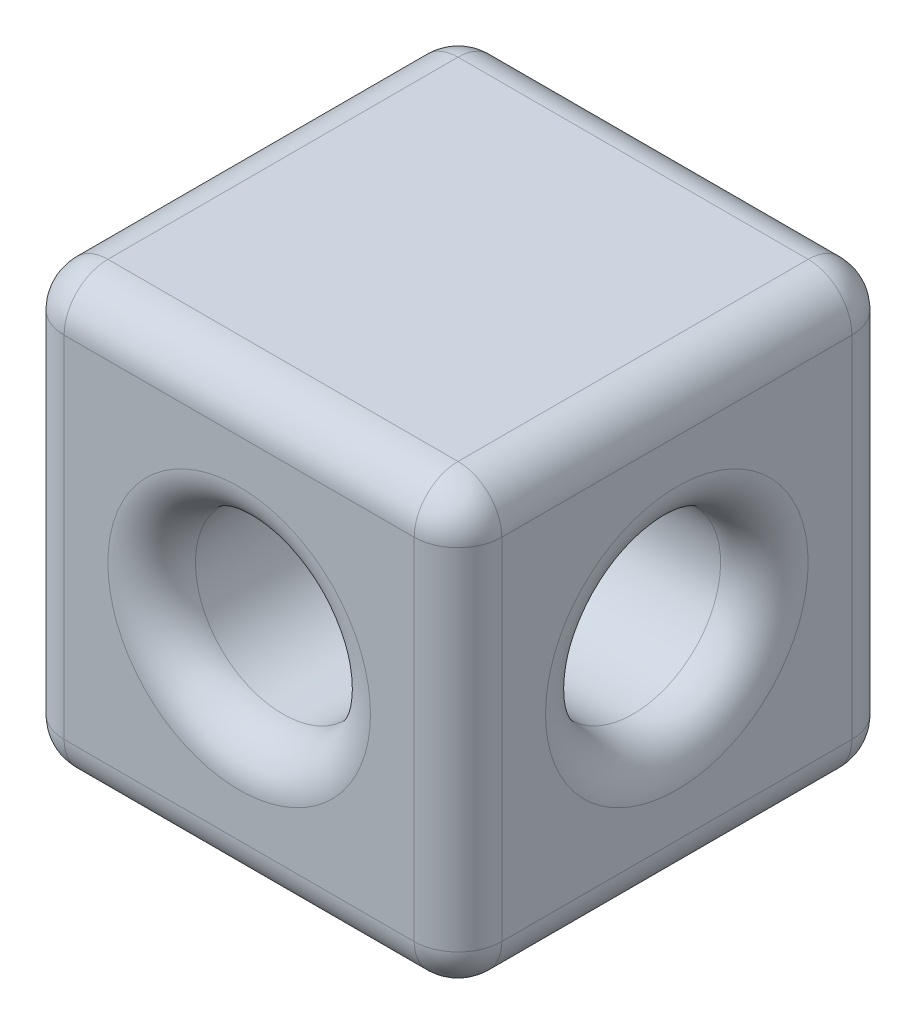
ISO-10303-21;
HEADER;
FILE_DESCRIPTION(('STEP AP214'),'2;1');
FILE_NAME('part.step','',(''),(''),'','','');
FILE_SCHEMA(('AUTOMOTIVE_DESIGN { 1 0 10303 214 1 1 1 1 }'));
ENDSEC;
DATA;
#1=APPLICATION_CONTEXT('core data for automotive mechanical design processes');
#2=APPLICATION_PROTOCOL_DEFINITION('international standard','automotive_design',2000,#1);
#3=PRODUCT_CONTEXT('',#1,'mechanical');
#4=PRODUCT('Part','Part','',(#3));
#5=PRODUCT_RELATED_PRODUCT_CATEGORY('part','',(#4));
#6=PRODUCT_DEFINITION_FORMATION('','',#4);
#7=PRODUCT_DEFINITION_CONTEXT('part definition',#1,'design');
#8=PRODUCT_DEFINITION('design','',#6,#7);
#9=PRODUCT_DEFINITION_SHAPE('','',#8);
#10=(LENGTH_UNIT() NAMED_UNIT(*) SI_UNIT(.MILLI.,.METRE.));
#11=(NAMED_UNIT(*) PLANE_ANGLE_UNIT() SI_UNIT($,.RADIAN.));
#12=(NAMED_UNIT(*) SI_UNIT($,.STERADIAN.) SOLID_ANGLE_UNIT());
#13=UNCERTAINTY_MEASURE_WITH_UNIT(LENGTH_MEASURE(1.E-05),#10,'distance_accuracy_value','');
#14=(GEOMETRIC_REPRESENTATION_CONTEXT(3) GLOBAL_UNCERTAINTY_ASSIGNED_CONTEXT((#13)) GLOBAL_UNIT_ASSIGNED_CONTEXT((#10,
#11,#12)) REPRESENTATION_CONTEXT('',''));
#15=CARTESIAN_POINT('',(0.,0.,0.));
#16=DIRECTION('',(0.,0.,1.));
#17=DIRECTION('',(1.,0.,0.));
#18=AXIS2_PLACEMENT_3D('',#15,#16,#17);
#19=CARTESIAN_POINT('',(0.,0.,5.));
#20=DIRECTION('',(0.,0.,-1.));
#21=DIRECTION('',(-1.,0.,0.));
#22=AXIS2_PLACEMENT_3D('',#19,#20,#21);
#23=CYLINDRICAL_SURFACE('',#22,1.);
#24=CARTESIAN_POINT('',(0.,0.,4.5));
#25=DIRECTION('',(0.,0.,-1.));
#26=DIRECTION('',(-1.,0.,0.));
#27=AXIS2_PLACEMENT_3D('',#24,#25,#26);
#28=CIRCLE('',#27,1.);
#29=CARTESIAN_POINT('',(-0.999999999999999,0.,4.5));
#30=VERTEX_POINT('',#29);
#31=EDGE_CURVE('E171',#30,#30,#28,.F.);
#32=ORIENTED_EDGE('',*,*,#31,.T.);
#33=EDGE_LOOP('',(#32));
#34=FACE_BOUND('',#33,.T.);
#35=CARTESIAN_POINT('',(0.,0.,2.5));
#36=DIRECTION('',(0.707106781186547,0.,-0.707106781186547));
#37=DIRECTION('',(-0.707106781186547,0.,-0.707106781186547));
#38=AXIS2_PLACEMENT_3D('',#35,#36,#37);
#39=ELLIPSE('',#38,1.41421356237309,1.);
#40=CARTESIAN_POINT('',(0.,-1.,2.5));
#41=VERTEX_POINT('',#40);
#42=CARTESIAN_POINT('',(0.,1.,2.5));
#43=VERTEX_POINT('',#42);
#44=EDGE_CURVE('E132',#41,#43,#39,.F.);
#45=ORIENTED_EDGE('',*,*,#44,.F.);
#46=CARTESIAN_POINT('',(0.,0.,2.5));
#47=DIRECTION('',(-0.707106781186547,0.,-0.707106781186547));
#48=DIRECTION('',(0.707106781186547,0.,-0.707106781186547));
#49=AXIS2_PLACEMENT_3D('',#46,#47,#48);
#50=ELLIPSE('',#49,1.41421356237309,1.);
#51=EDGE_CURVE('E136',#43,#41,#50,.F.);
#52=ORIENTED_EDGE('',*,*,#51,.F.);
#53=EDGE_LOOP('',(#45,#52));
#54=FACE_BOUND('',#53,.T.);
#55=ADVANCED_FACE('F32',(#34,#54),#23,.F.);
#56=CARTESIAN_POINT('',(0.,0.,5.));
#57=DIRECTION('',(0.,0.,-1.));
#58=DIRECTION('',(-1.,0.,0.));
#59=AXIS2_PLACEMENT_3D('',#56,#57,#58);
#60=PLANE('',#59);
#61=CARTESIAN_POINT('',(0.,0.,5.));
#62=DIRECTION('',(0.,0.,-1.));
#63=DIRECTION('',(-1.,0.,0.));
#64=AXIS2_PLACEMENT_3D('',#61,#62,#63);
#65=CIRCLE('',#64,1.5);
#66=CARTESIAN_POINT('',(-1.5,0.,5.));
#67=VERTEX_POINT('',#66);
#68=EDGE_CURVE('E183',#67,#67,#65,.T.);
#69=ORIENTED_EDGE('',*,*,#68,.T.);
#70=EDGE_LOOP('',(#69));
#71=FACE_BOUND('',#70,.T.);
#72=DIRECTION('',(0.,-1.,0.));
#73=VECTOR('',#72,1.);
#74=CARTESIAN_POINT('',(-2.,0.,5.));
#75=LINE('',#74,#73);
#76=CARTESIAN_POINT('',(-2.,2.,5.));
#77=VERTEX_POINT('',#76);
#78=CARTESIAN_POINT('',(-2.,-2.,5.));
#79=VERTEX_POINT('',#78);
#80=EDGE_CURVE('E178',#77,#79,#75,.T.);
#81=ORIENTED_EDGE('',*,*,#80,.T.);
#82=DIRECTION('',(1.,0.,0.));
#83=VECTOR('',#82,1.);
#84=CARTESIAN_POINT('',(0.,-2.,5.));
#85=LINE('',#84,#83);
#86=CARTESIAN_POINT('',(2.,-2.,5.));
#87=VERTEX_POINT('',#86);
#88=EDGE_CURVE('E180',#79,#87,#85,.T.);
#89=ORIENTED_EDGE('',*,*,#88,.T.);
#90=DIRECTION('',(0.,1.,0.));
#91=VECTOR('',#90,1.);
#92=CARTESIAN_POINT('',(2.,0.,5.));
#93=LINE('',#92,#91);
#94=CARTESIAN_POINT('',(2.,2.,5.));
#95=VERTEX_POINT('',#94);
#96=EDGE_CURVE('E174',#87,#95,#93,.T.);
#97=ORIENTED_EDGE('',*,*,#96,.T.);
#98=DIRECTION('',(-1.,0.,0.));
#99=VECTOR('',#98,1.);
#100=CARTESIAN_POINT('',(0.,2.,5.));
#101=LINE('',#100,#99);
#102=EDGE_CURVE('E176',#95,#77,#101,.T.);
#103=ORIENTED_EDGE('',*,*,#102,.T.);
#104=EDGE_LOOP('',(#81,#89,#97,#103));
#105=FACE_BOUND('',#104,.T.);
#106=ADVANCED_FACE('F319',(#71,#105),#60,.F.);
#107=CARTESIAN_POINT('',(0.,0.,0.));
#108=DIRECTION('',(0.,0.,-1.));
#109=DIRECTION('',(-1.,0.,0.));
#110=AXIS2_PLACEMENT_3D('',#107,#108,#109);
#111=PLANE('',#110);
#112=CARTESIAN_POINT('',(0.,0.,0.));
#113=DIRECTION('',(0.,0.,-1.));
#114=DIRECTION('',(-1.,0.,0.));
#115=AXIS2_PLACEMENT_3D('',#112,#113,#114);
#116=CIRCLE('',#115,1.5);
#117=CARTESIAN_POINT('',(-1.5,0.,0.));
#118=VERTEX_POINT('',#117);
#119=EDGE_CURVE('E41',#118,#118,#116,.F.);
#120=ORIENTED_EDGE('',*,*,#119,.T.);
#121=EDGE_LOOP('',(#120));
#122=FACE_BOUND('',#121,.T.);
#123=DIRECTION('',(0.,-1.,0.));
#124=VECTOR('',#123,1.);
#125=CARTESIAN_POINT('',(-2.,2.5,0.));
#126=LINE('',#125,#124);
#127=CARTESIAN_POINT('',(-2.,-2.,0.));
#128=VERTEX_POINT('',#127);
#129=CARTESIAN_POINT('',(-2.,2.,0.));
#130=VERTEX_POINT('',#129);
#131=EDGE_CURVE('E49',#128,#130,#126,.F.);
#132=ORIENTED_EDGE('',*,*,#131,.T.);
#133=DIRECTION('',(-1.,0.,0.));
#134=VECTOR('',#133,1.);
#135=CARTESIAN_POINT('',(2.5,2.,0.));
#136=LINE('',#135,#134);
#137=CARTESIAN_POINT('',(2.,2.,0.));
#138=VERTEX_POINT('',#137);
#139=EDGE_CURVE('E214',#130,#138,#136,.F.);
#140=ORIENTED_EDGE('',*,*,#139,.T.);
#141=DIRECTION('',(0.,1.,0.));
#142=VECTOR('',#141,1.);
#143=CARTESIAN_POINT('',(2.,-2.5,0.));
#144=LINE('',#143,#142);
#145=CARTESIAN_POINT('',(2.,-2.,0.));
#146=VERTEX_POINT('',#145);
#147=EDGE_CURVE('E210',#138,#146,#144,.F.);
#148=ORIENTED_EDGE('',*,*,#147,.T.);
#149=DIRECTION('',(1.,0.,0.));
#150=VECTOR('',#149,1.);
#151=CARTESIAN_POINT('',(-2.5,-2.,0.));
#152=LINE('',#151,#150);
#153=EDGE_CURVE('E54',#146,#128,#152,.F.);
#154=ORIENTED_EDGE('',*,*,#153,.T.);
#155=EDGE_LOOP('',(#132,#140,#148,#154));
#156=FACE_BOUND('',#155,.T.);
#157=ADVANCED_FACE('F350',(#122,#156),#111,.T.);
#158=CARTESIAN_POINT('',(2.5,-2.5,5.));
#159=DIRECTION('',(-1.,0.,0.));
#160=DIRECTION('',(0.,0.,1.));
#161=AXIS2_PLACEMENT_3D('',#158,#159,#160);
#162=PLANE('',#161);
#163=CARTESIAN_POINT('',(2.5,0.,2.5));
#164=DIRECTION('',(-1.,0.,0.));
#165=DIRECTION('',(0.,0.,1.));
#166=AXIS2_PLACEMENT_3D('',#163,#164,#165);
#167=CIRCLE('',#166,1.5);
#168=CARTESIAN_POINT('',(2.5,0.,4.));
#169=VERTEX_POINT('',#168);
#170=EDGE_CURVE('E204',#169,#169,#167,.T.);
#171=ORIENTED_EDGE('',*,*,#170,.T.);
#172=EDGE_LOOP('',(#171));
#173=FACE_BOUND('',#172,.T.);
#174=DIRECTION('',(0.,1.,0.));
#175=VECTOR('',#174,1.);
#176=CARTESIAN_POINT('',(2.5,-2.5,4.5));
#177=LINE('',#176,#175);
#178=CARTESIAN_POINT('',(2.5,2.,4.5));
#179=VERTEX_POINT('',#178);
#180=CARTESIAN_POINT('',(2.5,-2.,4.5));
#181=VERTEX_POINT('',#180);
#182=EDGE_CURVE('E199',#179,#181,#177,.F.);
#183=ORIENTED_EDGE('',*,*,#182,.T.);
#184=DIRECTION('',(0.,0.,-1.));
#185=VECTOR('',#184,1.);
#186=CARTESIAN_POINT('',(2.5,-2.,5.));
#187=LINE('',#186,#185);
#188=CARTESIAN_POINT('',(2.5,-2.,0.5));
#189=VERTEX_POINT('',#188);
#190=EDGE_CURVE('E201',#181,#189,#187,.T.);
#191=ORIENTED_EDGE('',*,*,#190,.T.);
#192=DIRECTION('',(0.,1.,0.));
#193=VECTOR('',#192,1.);
#194=CARTESIAN_POINT('',(2.5,2.5,0.5));
#195=LINE('',#194,#193);
#196=CARTESIAN_POINT('',(2.5,2.,0.5));
#197=VERTEX_POINT('',#196);
#198=EDGE_CURVE('E195',#189,#197,#195,.T.);
#199=ORIENTED_EDGE('',*,*,#198,.T.);
#200=DIRECTION('',(0.,0.,-1.));
#201=VECTOR('',#200,1.);
#202=CARTESIAN_POINT('',(2.5,2.,5.));
#203=LINE('',#202,#201);
#204=EDGE_CURVE('E197',#197,#179,#203,.F.);
#205=ORIENTED_EDGE('',*,*,#204,.T.);
#206=EDGE_LOOP('',(#183,#191,#199,#205));
#207=FACE_BOUND('',#206,.T.);
#208=ADVANCED_FACE('F335',(#173,#207),#162,.F.);
#209=CARTESIAN_POINT('',(-2.5,2.5,5.));
#210=DIRECTION('',(0.,-1.,0.));
#211=DIRECTION('',(0.,0.,-1.));
#212=AXIS2_PLACEMENT_3D('',#209,#210,#211);
#213=PLANE('',#212);
#214=DIRECTION('',(0.,0.,-1.));
#215=VECTOR('',#214,1.);
#216=CARTESIAN_POINT('',(-2.,2.5,5.));
#217=LINE('',#216,#215);
#218=CARTESIAN_POINT('',(-2.,2.5,0.5));
#219=VERTEX_POINT('',#218);
#220=CARTESIAN_POINT('',(-2.,2.5,4.5));
#221=VERTEX_POINT('',#220);
#222=EDGE_CURVE('E190',#219,#221,#217,.F.);
#223=ORIENTED_EDGE('',*,*,#222,.T.);
#224=DIRECTION('',(-1.,0.,0.));
#225=VECTOR('',#224,1.);
#226=CARTESIAN_POINT('',(-2.5,2.5,4.5));
#227=LINE('',#226,#225);
#228=CARTESIAN_POINT('',(2.,2.5,4.5));
#229=VERTEX_POINT('',#228);
#230=EDGE_CURVE('E192',#221,#229,#227,.F.);
#231=ORIENTED_EDGE('',*,*,#230,.T.);
#232=DIRECTION('',(0.,0.,-1.));
#233=VECTOR('',#232,1.);
#234=CARTESIAN_POINT('',(2.,2.5,5.));
#235=LINE('',#234,#233);
#236=CARTESIAN_POINT('',(2.,2.5,0.5));
#237=VERTEX_POINT('',#236);
#238=EDGE_CURVE('E188',#229,#237,#235,.T.);
#239=ORIENTED_EDGE('',*,*,#238,.T.);
#240=DIRECTION('',(-1.,0.,0.));
#241=VECTOR('',#240,1.);
#242=CARTESIAN_POINT('',(-2.5,2.5,0.5));
#243=LINE('',#242,#241);
#244=EDGE_CURVE('E186',#237,#219,#243,.T.);
#245=ORIENTED_EDGE('',*,*,#244,.T.);
#246=EDGE_LOOP('',(#223,#231,#239,#245));
#247=FACE_BOUND('',#246,.T.);
#248=ADVANCED_FACE('F298',(#247),#213,.F.);
#249=CARTESIAN_POINT('',(-2.5,-2.5,5.));
#250=DIRECTION('',(1.,0.,0.));
#251=DIRECTION('',(0.,0.,-1.));
#252=AXIS2_PLACEMENT_3D('',#249,#250,#251);
#253=PLANE('',#252);
#254=CARTESIAN_POINT('',(-2.5,0.,2.5));
#255=DIRECTION('',(1.,0.,0.));
#256=DIRECTION('',(0.,0.,-1.));
#257=AXIS2_PLACEMENT_3D('',#254,#255,#256);
#258=CIRCLE('',#257,1.5);
#259=CARTESIAN_POINT('',(-2.5,0.,1.));
#260=VERTEX_POINT('',#259);
#261=EDGE_CURVE('E165',#260,#260,#258,.T.);
#262=ORIENTED_EDGE('',*,*,#261,.T.);
#263=EDGE_LOOP('',(#262));
#264=FACE_BOUND('',#263,.T.);
#265=DIRECTION('',(0.,-1.,0.));
#266=VECTOR('',#265,1.);
#267=CARTESIAN_POINT('',(-2.5,-2.5,0.5));
#268=LINE('',#267,#266);
#269=CARTESIAN_POINT('',(-2.5,2.,0.5));
#270=VERTEX_POINT('',#269);
#271=CARTESIAN_POINT('',(-2.5,-2.,0.5));
#272=VERTEX_POINT('',#271);
#273=EDGE_CURVE('E156',#270,#272,#268,.T.);
#274=ORIENTED_EDGE('',*,*,#273,.T.);
#275=DIRECTION('',(0.,0.,-1.));
#276=VECTOR('',#275,1.);
#277=CARTESIAN_POINT('',(-2.5,-2.,5.));
#278=LINE('',#277,#276);
#279=CARTESIAN_POINT('',(-2.5,-2.,4.5));
#280=VERTEX_POINT('',#279);
#281=EDGE_CURVE('E162',#272,#280,#278,.F.);
#282=ORIENTED_EDGE('',*,*,#281,.T.);
#283=DIRECTION('',(0.,-1.,0.));
#284=VECTOR('',#283,1.);
#285=CARTESIAN_POINT('',(-2.5,-2.5,4.5));
#286=LINE('',#285,#284);
#287=CARTESIAN_POINT('',(-2.5,2.,4.5));
#288=VERTEX_POINT('',#287);
#289=EDGE_CURVE('E160',#280,#288,#286,.F.);
#290=ORIENTED_EDGE('',*,*,#289,.T.);
#291=DIRECTION('',(0.,0.,-1.));
#292=VECTOR('',#291,1.);
#293=CARTESIAN_POINT('',(-2.5,2.,5.));
#294=LINE('',#293,#292);
#295=EDGE_CURVE('E158',#288,#270,#294,.T.);
#296=ORIENTED_EDGE('',*,*,#295,.T.);
#297=EDGE_LOOP('',(#274,#282,#290,#296));
#298=FACE_BOUND('',#297,.T.);
#299=ADVANCED_FACE('F377',(#264,#298),#253,.F.);
#300=CARTESIAN_POINT('',(-2.5,-2.5,5.));
#301=DIRECTION('',(0.,1.,0.));
#302=DIRECTION('',(0.,0.,1.));
#303=AXIS2_PLACEMENT_3D('',#300,#301,#302);
#304=PLANE('',#303);
#305=DIRECTION('',(1.,0.,0.));
#306=VECTOR('',#305,1.);
#307=CARTESIAN_POINT('',(-2.5,-2.5,4.5));
#308=LINE('',#307,#306);
#309=CARTESIAN_POINT('',(2.,-2.5,4.5));
#310=VERTEX_POINT('',#309);
#311=CARTESIAN_POINT('',(-2.,-2.5,4.5));
#312=VERTEX_POINT('',#311);
#313=EDGE_CURVE('E151',#310,#312,#308,.F.);
#314=ORIENTED_EDGE('',*,*,#313,.T.);
#315=DIRECTION('',(0.,0.,-1.));
#316=VECTOR('',#315,1.);
#317=CARTESIAN_POINT('',(-2.,-2.5,5.));
#318=LINE('',#317,#316);
#319=CARTESIAN_POINT('',(-2.,-2.5,0.5));
#320=VERTEX_POINT('',#319);
#321=EDGE_CURVE('E153',#312,#320,#318,.T.);
#322=ORIENTED_EDGE('',*,*,#321,.T.);
#323=DIRECTION('',(1.,0.,0.));
#324=VECTOR('',#323,1.);
#325=CARTESIAN_POINT('',(2.5,-2.5,0.5));
#326=LINE('',#325,#324);
#327=CARTESIAN_POINT('',(2.,-2.5,0.5));
#328=VERTEX_POINT('',#327);
#329=EDGE_CURVE('E143',#320,#328,#326,.T.);
#330=ORIENTED_EDGE('',*,*,#329,.T.);
#331=DIRECTION('',(0.,0.,-1.));
#332=VECTOR('',#331,1.);
#333=CARTESIAN_POINT('',(2.,-2.5,5.));
#334=LINE('',#333,#332);
#335=EDGE_CURVE('E149',#328,#310,#334,.F.);
#336=ORIENTED_EDGE('',*,*,#335,.T.);
#337=EDGE_LOOP('',(#314,#322,#330,#336));
#338=FACE_BOUND('',#337,.T.);
#339=ADVANCED_FACE('F370',(#338),#304,.F.);
#340=CARTESIAN_POINT('',(0.,0.,0.5));
#341=DIRECTION('',(0.,0.,-1.));
#342=DIRECTION('',(-1.,0.,0.));
#343=AXIS2_PLACEMENT_3D('',#340,#341,#342);
#344=CIRCLE('',#343,1.);
#345=CARTESIAN_POINT('',(-0.999999999999999,0.,0.5));
#346=VERTEX_POINT('',#345);
#347=EDGE_CURVE('E11',#346,#346,#344,.T.);
#348=ORIENTED_EDGE('',*,*,#347,.T.);
#349=EDGE_LOOP('',(#348));
#350=FACE_BOUND('',#349,.T.);
#351=CARTESIAN_POINT('',(0.,0.,2.5));
#352=DIRECTION('',(0.707106781186547,0.,-0.707106781186547));
#353=DIRECTION('',(-0.707106781186547,0.,-0.707106781186547));
#354=AXIS2_PLACEMENT_3D('',#351,#352,#353);
#355=ELLIPSE('',#354,1.41421356237309,1.);
#356=EDGE_CURVE('E135',#41,#43,#355,.T.);
#357=ORIENTED_EDGE('',*,*,#356,.F.);
#358=CARTESIAN_POINT('',(0.,0.,2.5));
#359=DIRECTION('',(-0.707106781186547,0.,-0.707106781186547));
#360=DIRECTION('',(0.707106781186547,0.,-0.707106781186547));
#361=AXIS2_PLACEMENT_3D('',#358,#359,#360);
#362=ELLIPSE('',#361,1.41421356237309,1.);
#363=EDGE_CURVE('E128',#43,#41,#362,.T.);
#364=ORIENTED_EDGE('',*,*,#363,.F.);
#365=EDGE_LOOP('',(#357,#364));
#366=FACE_BOUND('',#365,.T.);
#367=ADVANCED_FACE('F145',(#350,#366),#23,.F.);
#368=CARTESIAN_POINT('',(-7.5,0.,2.5));
#369=DIRECTION('',(1.,0.,0.));
#370=DIRECTION('',(0.,0.,-1.));
#371=AXIS2_PLACEMENT_3D('',#368,#369,#370);
#372=CYLINDRICAL_SURFACE('',#371,1.);
#373=CARTESIAN_POINT('',(-2.,0.,2.5));
#374=DIRECTION('',(1.,0.,0.));
#375=DIRECTION('',(0.,0.,-1.));
#376=AXIS2_PLACEMENT_3D('',#373,#374,#375);
#377=CIRCLE('',#376,1.);
#378=CARTESIAN_POINT('',(-2.,0.,1.5));
#379=VERTEX_POINT('',#378);
#380=EDGE_CURVE('E168',#379,#379,#377,.F.);
#381=ORIENTED_EDGE('',*,*,#380,.T.);
#382=EDGE_LOOP('',(#381));
#383=FACE_BOUND('',#382,.T.);
#384=ORIENTED_EDGE('',*,*,#356,.T.);
#385=ORIENTED_EDGE('',*,*,#51,.T.);
#386=EDGE_LOOP('',(#384,#385));
#387=FACE_BOUND('',#386,.T.);
#388=ADVANCED_FACE('F140',(#383,#387),#372,.F.);
#389=CARTESIAN_POINT('',(2.,0.,2.5));
#390=DIRECTION('',(-1.,0.,0.));
#391=DIRECTION('',(0.,0.,1.));
#392=AXIS2_PLACEMENT_3D('',#389,#390,#391);
#393=CIRCLE('',#392,1.);
#394=CARTESIAN_POINT('',(2.,0.,3.5));
#395=VERTEX_POINT('',#394);
#396=EDGE_CURVE('E207',#395,#395,#393,.F.);
#397=ORIENTED_EDGE('',*,*,#396,.T.);
#398=EDGE_LOOP('',(#397));
#399=FACE_BOUND('',#398,.T.);
#400=ORIENTED_EDGE('',*,*,#44,.T.);
#401=ORIENTED_EDGE('',*,*,#363,.T.);
#402=EDGE_LOOP('',(#400,#401));
#403=FACE_BOUND('',#402,.T.);
#404=ADVANCED_FACE('F130',(#399,#403),#372,.F.);
#405=CARTESIAN_POINT('',(2.,2.,5.));
#406=DIRECTION('',(0.,0.,-1.));
#407=DIRECTION('',(-1.,0.,0.));
#408=AXIS2_PLACEMENT_3D('',#405,#406,#407);
#409=CYLINDRICAL_SURFACE('',#408,0.5);
#410=CARTESIAN_POINT('',(2.,2.,4.5));
#411=DIRECTION('',(0.,0.,1.));
#412=DIRECTION('',(1.,0.,0.));
#413=AXIS2_PLACEMENT_3D('',#410,#411,#412);
#414=CIRCLE('',#413,0.5);
#415=EDGE_CURVE('E36',#179,#229,#414,.T.);
#416=ORIENTED_EDGE('',*,*,#415,.F.);
#417=ORIENTED_EDGE('',*,*,#204,.F.);
#418=CARTESIAN_POINT('',(2.,2.,0.5));
#419=DIRECTION('',(0.,0.,-1.));
#420=DIRECTION('',(-1.,0.,0.));
#421=AXIS2_PLACEMENT_3D('',#418,#419,#420);
#422=CIRCLE('',#421,0.5);
#423=EDGE_CURVE('E278',#237,#197,#422,.T.);
#424=ORIENTED_EDGE('',*,*,#423,.F.);
#425=ORIENTED_EDGE('',*,*,#238,.F.);
#426=EDGE_LOOP('',(#416,#417,#424,#425));
#427=FACE_BOUND('',#426,.T.);
#428=ADVANCED_FACE('F295',(#427),#409,.T.);
#429=CARTESIAN_POINT('',(2.,2.,4.5));
#430=DIRECTION('',(0.,0.,1.));
#431=DIRECTION('',(1.,0.,0.));
#432=AXIS2_PLACEMENT_3D('',#429,#430,#431);
#433=SPHERICAL_SURFACE('',#432,0.5);
#434=CARTESIAN_POINT('',(2.,2.,4.5));
#435=DIRECTION('',(0.,1.,0.));
#436=DIRECTION('',(0.,0.,1.));
#437=AXIS2_PLACEMENT_3D('',#434,#435,#436);
#438=CIRCLE('',#437,0.5);
#439=EDGE_CURVE('E274',#179,#95,#438,.F.);
#440=ORIENTED_EDGE('',*,*,#439,.F.);
#441=ORIENTED_EDGE('',*,*,#415,.T.);
#442=CARTESIAN_POINT('',(2.,2.,4.5));
#443=DIRECTION('',(1.,0.,0.));
#444=DIRECTION('',(0.,0.,-1.));
#445=AXIS2_PLACEMENT_3D('',#442,#443,#444);
#446=CIRCLE('',#445,0.5);
#447=EDGE_CURVE('E277',#95,#229,#446,.F.);
#448=ORIENTED_EDGE('',*,*,#447,.F.);
#449=EDGE_LOOP('',(#440,#441,#448));
#450=FACE_BOUND('',#449,.T.);
#451=ADVANCED_FACE('F290',(#450),#433,.T.);
#452=CARTESIAN_POINT('',(2.,2.,0.5));
#453=DIRECTION('',(0.,0.,1.));
#454=DIRECTION('',(1.,0.,0.));
#455=AXIS2_PLACEMENT_3D('',#452,#453,#454);
#456=SPHERICAL_SURFACE('',#455,0.5);
#457=CARTESIAN_POINT('',(2.,2.,0.5));
#458=DIRECTION('',(1.,0.,0.));
#459=DIRECTION('',(0.,1.,0.));
#460=AXIS2_PLACEMENT_3D('',#457,#458,#459);
#461=CIRCLE('',#460,0.5);
#462=EDGE_CURVE('E268',#237,#138,#461,.F.);
#463=ORIENTED_EDGE('',*,*,#462,.F.);
#464=ORIENTED_EDGE('',*,*,#423,.T.);
#465=CARTESIAN_POINT('',(2.,2.,0.5));
#466=DIRECTION('',(0.,1.,0.));
#467=DIRECTION('',(0.,0.,1.));
#468=AXIS2_PLACEMENT_3D('',#465,#466,#467);
#469=CIRCLE('',#468,0.5);
#470=EDGE_CURVE('E271',#138,#197,#469,.F.);
#471=ORIENTED_EDGE('',*,*,#470,.F.);
#472=EDGE_LOOP('',(#463,#464,#471));
#473=FACE_BOUND('',#472,.T.);
#474=ADVANCED_FACE('F346',(#473),#456,.T.);
#475=CARTESIAN_POINT('',(0.,2.,4.5));
#476=DIRECTION('',(-1.,0.,0.));
#477=DIRECTION('',(0.,0.,1.));
#478=AXIS2_PLACEMENT_3D('',#475,#476,#477);
#479=CYLINDRICAL_SURFACE('',#478,0.5);
#480=ORIENTED_EDGE('',*,*,#447,.T.);
#481=ORIENTED_EDGE('',*,*,#230,.F.);
#482=CARTESIAN_POINT('',(-2.,2.,4.5));
#483=DIRECTION('',(-1.,0.,0.));
#484=DIRECTION('',(0.,0.,1.));
#485=AXIS2_PLACEMENT_3D('',#482,#483,#484);
#486=CIRCLE('',#485,0.5);
#487=EDGE_CURVE('E262',#77,#221,#486,.T.);
#488=ORIENTED_EDGE('',*,*,#487,.F.);
#489=ORIENTED_EDGE('',*,*,#102,.F.);
#490=EDGE_LOOP('',(#480,#481,#488,#489));
#491=FACE_BOUND('',#490,.T.);
#492=ADVANCED_FACE('F303',(#491),#479,.T.);
#493=CARTESIAN_POINT('',(2.,0.,4.5));
#494=DIRECTION('',(0.,1.,0.));
#495=DIRECTION('',(0.,0.,1.));
#496=AXIS2_PLACEMENT_3D('',#493,#494,#495);
#497=CYLINDRICAL_SURFACE('',#496,0.5);
#498=ORIENTED_EDGE('',*,*,#439,.T.);
#499=ORIENTED_EDGE('',*,*,#96,.F.);
#500=CARTESIAN_POINT('',(2.,-2.,4.5));
#501=DIRECTION('',(0.,-1.,0.));
#502=DIRECTION('',(0.,0.,-1.));
#503=AXIS2_PLACEMENT_3D('',#500,#501,#502);
#504=CIRCLE('',#503,0.5);
#505=EDGE_CURVE('E259',#181,#87,#504,.T.);
#506=ORIENTED_EDGE('',*,*,#505,.F.);
#507=ORIENTED_EDGE('',*,*,#182,.F.);
#508=EDGE_LOOP('',(#498,#499,#506,#507));
#509=FACE_BOUND('',#508,.T.);
#510=ADVANCED_FACE('F332',(#509),#497,.T.);
#511=CARTESIAN_POINT('',(2.,-2.,5.));
#512=DIRECTION('',(0.,0.,-1.));
#513=DIRECTION('',(-1.,0.,0.));
#514=AXIS2_PLACEMENT_3D('',#511,#512,#513);
#515=CYLINDRICAL_SURFACE('',#514,0.5);
#516=CARTESIAN_POINT('',(2.,-2.,0.5));
#517=DIRECTION('',(0.,0.,-1.));
#518=DIRECTION('',(-1.,0.,0.));
#519=AXIS2_PLACEMENT_3D('',#516,#517,#518);
#520=CIRCLE('',#519,0.5);
#521=EDGE_CURVE('E253',#189,#328,#520,.T.);
#522=ORIENTED_EDGE('',*,*,#521,.F.);
#523=ORIENTED_EDGE('',*,*,#190,.F.);
#524=CARTESIAN_POINT('',(2.,-2.,4.5));
#525=DIRECTION('',(0.,0.,1.));
#526=DIRECTION('',(1.,0.,0.));
#527=AXIS2_PLACEMENT_3D('',#524,#525,#526);
#528=CIRCLE('',#527,0.5);
#529=EDGE_CURVE('E256',#310,#181,#528,.T.);
#530=ORIENTED_EDGE('',*,*,#529,.F.);
#531=ORIENTED_EDGE('',*,*,#335,.F.);
#532=EDGE_LOOP('',(#522,#523,#530,#531));
#533=FACE_BOUND('',#532,.T.);
#534=ADVANCED_FACE('F338',(#533),#515,.T.);
#535=CARTESIAN_POINT('',(2.,-2.5,0.5));
#536=DIRECTION('',(0.,-1.,0.));
#537=DIRECTION('',(0.,0.,-1.));
#538=AXIS2_PLACEMENT_3D('',#535,#536,#537);
#539=CYLINDRICAL_SURFACE('',#538,0.5);
#540=ORIENTED_EDGE('',*,*,#470,.T.);
#541=ORIENTED_EDGE('',*,*,#198,.F.);
#542=CARTESIAN_POINT('',(2.,-2.,0.5));
#543=DIRECTION('',(0.,-1.,0.));
#544=DIRECTION('',(0.,0.,-1.));
#545=AXIS2_PLACEMENT_3D('',#542,#543,#544);
#546=CIRCLE('',#545,0.5);
#547=EDGE_CURVE('E251',#146,#189,#546,.T.);
#548=ORIENTED_EDGE('',*,*,#547,.F.);
#549=ORIENTED_EDGE('',*,*,#147,.F.);
#550=EDGE_LOOP('',(#540,#541,#548,#549));
#551=FACE_BOUND('',#550,.T.);
#552=ADVANCED_FACE('F345',(#551),#539,.T.);
#553=CARTESIAN_POINT('',(-2.5,2.,0.5));
#554=DIRECTION('',(1.,0.,0.));
#555=DIRECTION('',(0.,0.,-1.));
#556=AXIS2_PLACEMENT_3D('',#553,#554,#555);
#557=CYLINDRICAL_SURFACE('',#556,0.5);
#558=ORIENTED_EDGE('',*,*,#462,.T.);
#559=ORIENTED_EDGE('',*,*,#139,.F.);
#560=CARTESIAN_POINT('',(-2.,2.,0.5));
#561=DIRECTION('',(-1.,0.,0.));
#562=DIRECTION('',(0.,0.,1.));
#563=AXIS2_PLACEMENT_3D('',#560,#561,#562);
#564=CIRCLE('',#563,0.5);
#565=EDGE_CURVE('E248',#219,#130,#564,.T.);
#566=ORIENTED_EDGE('',*,*,#565,.F.);
#567=ORIENTED_EDGE('',*,*,#244,.F.);
#568=EDGE_LOOP('',(#558,#559,#566,#567));
#569=FACE_BOUND('',#568,.T.);
#570=ADVANCED_FACE('F349',(#569),#557,.T.);
#571=CARTESIAN_POINT('',(-2.,2.,5.));
#572=DIRECTION('',(0.,0.,-1.));
#573=DIRECTION('',(-1.,0.,0.));
#574=AXIS2_PLACEMENT_3D('',#571,#572,#573);
#575=CYLINDRICAL_SURFACE('',#574,0.5);
#576=CARTESIAN_POINT('',(-2.,2.,4.5));
#577=DIRECTION('',(0.,0.,1.));
#578=DIRECTION('',(1.,0.,0.));
#579=AXIS2_PLACEMENT_3D('',#576,#577,#578);
#580=CIRCLE('',#579,0.5);
#581=EDGE_CURVE('E265',#221,#288,#580,.T.);
#582=ORIENTED_EDGE('',*,*,#581,.F.);
#583=ORIENTED_EDGE('',*,*,#222,.F.);
#584=CARTESIAN_POINT('',(-2.,2.,0.5));
#585=DIRECTION('',(0.,0.,-1.));
#586=DIRECTION('',(-1.,0.,0.));
#587=AXIS2_PLACEMENT_3D('',#584,#585,#586);
#588=CIRCLE('',#587,0.5);
#589=EDGE_CURVE('E245',#270,#219,#588,.T.);
#590=ORIENTED_EDGE('',*,*,#589,.F.);
#591=ORIENTED_EDGE('',*,*,#295,.F.);
#592=EDGE_LOOP('',(#582,#583,#590,#591));
#593=FACE_BOUND('',#592,.T.);
#594=ADVANCED_FACE('F307',(#593),#575,.T.);
#595=CARTESIAN_POINT('',(-2.,2.,4.5));
#596=DIRECTION('',(0.,0.,1.));
#597=DIRECTION('',(1.,0.,0.));
#598=AXIS2_PLACEMENT_3D('',#595,#596,#597);
#599=SPHERICAL_SURFACE('',#598,0.5);
#600=ORIENTED_EDGE('',*,*,#487,.T.);
#601=ORIENTED_EDGE('',*,*,#581,.T.);
#602=CARTESIAN_POINT('',(-2.,2.,4.5));
#603=DIRECTION('',(0.,1.,0.));
#604=DIRECTION('',(0.,0.,1.));
#605=AXIS2_PLACEMENT_3D('',#602,#603,#604);
#606=CIRCLE('',#605,0.5);
#607=EDGE_CURVE('E242',#77,#288,#606,.F.);
#608=ORIENTED_EDGE('',*,*,#607,.F.);
#609=EDGE_LOOP('',(#600,#601,#608));
#610=FACE_BOUND('',#609,.T.);
#611=ADVANCED_FACE('F311',(#610),#599,.T.);
#612=CARTESIAN_POINT('',(2.,-2.,4.5));
#613=DIRECTION('',(0.,0.,1.));
#614=DIRECTION('',(1.,0.,0.));
#615=AXIS2_PLACEMENT_3D('',#612,#613,#614);
#616=SPHERICAL_SURFACE('',#615,0.5);
#617=ORIENTED_EDGE('',*,*,#529,.T.);
#618=ORIENTED_EDGE('',*,*,#505,.T.);
#619=CARTESIAN_POINT('',(2.,-2.,4.5));
#620=DIRECTION('',(1.,0.,0.));
#621=DIRECTION('',(0.,0.,-1.));
#622=AXIS2_PLACEMENT_3D('',#619,#620,#621);
#623=CIRCLE('',#622,0.5);
#624=EDGE_CURVE('E240',#310,#87,#623,.F.);
#625=ORIENTED_EDGE('',*,*,#624,.F.);
#626=EDGE_LOOP('',(#617,#618,#625));
#627=FACE_BOUND('',#626,.T.);
#628=ADVANCED_FACE('F329',(#627),#616,.T.);
#629=CARTESIAN_POINT('',(2.,-2.,0.5));
#630=DIRECTION('',(0.,0.,1.));
#631=DIRECTION('',(1.,0.,0.));
#632=AXIS2_PLACEMENT_3D('',#629,#630,#631);
#633=SPHERICAL_SURFACE('',#632,0.5);
#634=ORIENTED_EDGE('',*,*,#547,.T.);
#635=ORIENTED_EDGE('',*,*,#521,.T.);
#636=CARTESIAN_POINT('',(2.,-2.,0.5));
#637=DIRECTION('',(1.,0.,0.));
#638=DIRECTION('',(0.,0.,-1.));
#639=AXIS2_PLACEMENT_3D('',#636,#637,#638);
#640=CIRCLE('',#639,0.5);
#641=EDGE_CURVE('E237',#146,#328,#640,.F.);
#642=ORIENTED_EDGE('',*,*,#641,.F.);
#643=EDGE_LOOP('',(#634,#635,#642));
#644=FACE_BOUND('',#643,.T.);
#645=ADVANCED_FACE('F425',(#644),#633,.T.);
#646=CARTESIAN_POINT('',(-2.,2.,0.5));
#647=DIRECTION('',(0.,0.,1.));
#648=DIRECTION('',(1.,0.,0.));
#649=AXIS2_PLACEMENT_3D('',#646,#647,#648);
#650=SPHERICAL_SURFACE('',#649,0.5);
#651=ORIENTED_EDGE('',*,*,#589,.T.);
#652=ORIENTED_EDGE('',*,*,#565,.T.);
#653=CARTESIAN_POINT('',(-2.,2.,0.5));
#654=DIRECTION('',(0.,1.,0.));
#655=DIRECTION('',(-1.,0.,0.));
#656=AXIS2_PLACEMENT_3D('',#653,#654,#655);
#657=CIRCLE('',#656,0.5);
#658=EDGE_CURVE('E234',#270,#130,#657,.F.);
#659=ORIENTED_EDGE('',*,*,#658,.F.);
#660=EDGE_LOOP('',(#651,#652,#659));
#661=FACE_BOUND('',#660,.T.);
#662=ADVANCED_FACE('F428',(#661),#650,.T.);
#663=CARTESIAN_POINT('',(-2.,0.,4.5));
#664=DIRECTION('',(0.,-1.,0.));
#665=DIRECTION('',(0.,0.,-1.));
#666=AXIS2_PLACEMENT_3D('',#663,#664,#665);
#667=CYLINDRICAL_SURFACE('',#666,0.5);
#668=ORIENTED_EDGE('',*,*,#607,.T.);
#669=ORIENTED_EDGE('',*,*,#289,.F.);
#670=CARTESIAN_POINT('',(-2.,-2.,4.5));
#671=DIRECTION('',(0.,-1.,0.));
#672=DIRECTION('',(0.,0.,-1.));
#673=AXIS2_PLACEMENT_3D('',#670,#671,#672);
#674=CIRCLE('',#673,0.5);
#675=EDGE_CURVE('E231',#79,#280,#674,.T.);
#676=ORIENTED_EDGE('',*,*,#675,.F.);
#677=ORIENTED_EDGE('',*,*,#80,.F.);
#678=EDGE_LOOP('',(#668,#669,#676,#677));
#679=FACE_BOUND('',#678,.T.);
#680=ADVANCED_FACE('F316',(#679),#667,.T.);
#681=CARTESIAN_POINT('',(0.,-2.,4.5));
#682=DIRECTION('',(1.,0.,0.));
#683=DIRECTION('',(0.,0.,-1.));
#684=AXIS2_PLACEMENT_3D('',#681,#682,#683);
#685=CYLINDRICAL_SURFACE('',#684,0.5);
#686=ORIENTED_EDGE('',*,*,#624,.T.);
#687=ORIENTED_EDGE('',*,*,#88,.F.);
#688=CARTESIAN_POINT('',(-2.,-2.,4.5));
#689=DIRECTION('',(-1.,0.,0.));
#690=DIRECTION('',(0.,0.,1.));
#691=AXIS2_PLACEMENT_3D('',#688,#689,#690);
#692=CIRCLE('',#691,0.5);
#693=EDGE_CURVE('E228',#312,#79,#692,.T.);
#694=ORIENTED_EDGE('',*,*,#693,.F.);
#695=ORIENTED_EDGE('',*,*,#313,.F.);
#696=EDGE_LOOP('',(#686,#687,#694,#695));
#697=FACE_BOUND('',#696,.T.);
#698=ADVANCED_FACE('F322',(#697),#685,.T.);
#699=CARTESIAN_POINT('',(-2.5,-2.,0.5));
#700=DIRECTION('',(-1.,0.,0.));
#701=DIRECTION('',(0.,0.,1.));
#702=AXIS2_PLACEMENT_3D('',#699,#700,#701);
#703=CYLINDRICAL_SURFACE('',#702,0.5);
#704=ORIENTED_EDGE('',*,*,#641,.T.);
#705=ORIENTED_EDGE('',*,*,#329,.F.);
#706=CARTESIAN_POINT('',(-2.,-2.,0.5));
#707=DIRECTION('',(-1.,0.,0.));
#708=DIRECTION('',(0.,0.,1.));
#709=AXIS2_PLACEMENT_3D('',#706,#707,#708);
#710=CIRCLE('',#709,0.5);
#711=EDGE_CURVE('E225',#128,#320,#710,.T.);
#712=ORIENTED_EDGE('',*,*,#711,.F.);
#713=ORIENTED_EDGE('',*,*,#153,.F.);
#714=EDGE_LOOP('',(#704,#705,#712,#713));
#715=FACE_BOUND('',#714,.T.);
#716=ADVANCED_FACE('F436',(#715),#703,.T.);
#717=CARTESIAN_POINT('',(-2.,-2.5,0.5));
#718=DIRECTION('',(0.,1.,0.));
#719=DIRECTION('',(0.,0.,1.));
#720=AXIS2_PLACEMENT_3D('',#717,#718,#719);
#721=CYLINDRICAL_SURFACE('',#720,0.5);
#722=ORIENTED_EDGE('',*,*,#658,.T.);
#723=ORIENTED_EDGE('',*,*,#131,.F.);
#724=CARTESIAN_POINT('',(-2.,-2.,0.5));
#725=DIRECTION('',(0.,-1.,0.));
#726=DIRECTION('',(0.,0.,-1.));
#727=AXIS2_PLACEMENT_3D('',#724,#725,#726);
#728=CIRCLE('',#727,0.5);
#729=EDGE_CURVE('E222',#272,#128,#728,.T.);
#730=ORIENTED_EDGE('',*,*,#729,.F.);
#731=ORIENTED_EDGE('',*,*,#273,.F.);
#732=EDGE_LOOP('',(#722,#723,#730,#731));
#733=FACE_BOUND('',#732,.T.);
#734=ADVANCED_FACE('F439',(#733),#721,.T.);
#735=CARTESIAN_POINT('',(-2.,-2.,4.5));
#736=DIRECTION('',(0.,0.,1.));
#737=DIRECTION('',(1.,0.,0.));
#738=AXIS2_PLACEMENT_3D('',#735,#736,#737);
#739=SPHERICAL_SURFACE('',#738,0.5);
#740=ORIENTED_EDGE('',*,*,#693,.T.);
#741=ORIENTED_EDGE('',*,*,#675,.T.);
#742=CARTESIAN_POINT('',(-2.,-2.,4.5));
#743=DIRECTION('',(0.,0.,1.));
#744=DIRECTION('',(1.,0.,0.));
#745=AXIS2_PLACEMENT_3D('',#742,#743,#744);
#746=CIRCLE('',#745,0.5);
#747=EDGE_CURVE('E220',#312,#280,#746,.F.);
#748=ORIENTED_EDGE('',*,*,#747,.F.);
#749=EDGE_LOOP('',(#740,#741,#748));
#750=FACE_BOUND('',#749,.T.);
#751=ADVANCED_FACE('F443',(#750),#739,.T.);
#752=CARTESIAN_POINT('',(-2.,-2.,0.5));
#753=DIRECTION('',(0.,0.,1.));
#754=DIRECTION('',(1.,0.,0.));
#755=AXIS2_PLACEMENT_3D('',#752,#753,#754);
#756=SPHERICAL_SURFACE('',#755,0.5);
#757=ORIENTED_EDGE('',*,*,#729,.T.);
#758=ORIENTED_EDGE('',*,*,#711,.T.);
#759=CARTESIAN_POINT('',(-2.,-2.,0.5));
#760=DIRECTION('',(0.,0.,-1.));
#761=DIRECTION('',(-1.,0.,0.));
#762=AXIS2_PLACEMENT_3D('',#759,#760,#761);
#763=CIRCLE('',#762,0.5);
#764=EDGE_CURVE('E218',#272,#320,#763,.F.);
#765=ORIENTED_EDGE('',*,*,#764,.F.);
#766=EDGE_LOOP('',(#757,#758,#765));
#767=FACE_BOUND('',#766,.T.);
#768=ADVANCED_FACE('F447',(#767),#756,.T.);
#769=CARTESIAN_POINT('',(-2.,-2.,5.));
#770=DIRECTION('',(0.,0.,-1.));
#771=DIRECTION('',(-1.,0.,0.));
#772=AXIS2_PLACEMENT_3D('',#769,#770,#771);
#773=CYLINDRICAL_SURFACE('',#772,0.5);
#774=ORIENTED_EDGE('',*,*,#747,.T.);
#775=ORIENTED_EDGE('',*,*,#281,.F.);
#776=ORIENTED_EDGE('',*,*,#764,.T.);
#777=ORIENTED_EDGE('',*,*,#321,.F.);
#778=EDGE_LOOP('',(#774,#775,#776,#777));
#779=FACE_BOUND('',#778,.T.);
#780=ADVANCED_FACE('F401',(#779),#773,.T.);
#781=CARTESIAN_POINT('',(-2.,0.,2.5));
#782=DIRECTION('',(1.,0.,0.));
#783=DIRECTION('',(0.,0.,-1.));
#784=AXIS2_PLACEMENT_3D('',#781,#782,#783);
#785=TOROIDAL_SURFACE('',#784,1.5,0.5);
#786=ORIENTED_EDGE('',*,*,#380,.F.);
#787=EDGE_LOOP('',(#786));
#788=FACE_BOUND('',#787,.T.);
#789=ORIENTED_EDGE('',*,*,#261,.F.);
#790=EDGE_LOOP('',(#789));
#791=FACE_BOUND('',#790,.T.);
#792=ADVANCED_FACE('F393',(#788,#791),#785,.T.);
#793=CARTESIAN_POINT('',(0.,0.,4.5));
#794=DIRECTION('',(0.,0.,-1.));
#795=DIRECTION('',(-1.,0.,0.));
#796=AXIS2_PLACEMENT_3D('',#793,#794,#795);
#797=TOROIDAL_SURFACE('',#796,1.5,0.5);
#798=ORIENTED_EDGE('',*,*,#68,.F.);
#799=EDGE_LOOP('',(#798));
#800=FACE_BOUND('',#799,.T.);
#801=ORIENTED_EDGE('',*,*,#31,.F.);
#802=EDGE_LOOP('',(#801));
#803=FACE_BOUND('',#802,.T.);
#804=ADVANCED_FACE('F388',(#800,#803),#797,.T.);
#805=CARTESIAN_POINT('',(2.,0.,2.5));
#806=DIRECTION('',(-1.,0.,0.));
#807=DIRECTION('',(0.,0.,1.));
#808=AXIS2_PLACEMENT_3D('',#805,#806,#807);
#809=TOROIDAL_SURFACE('',#808,1.5,0.5);
#810=ORIENTED_EDGE('',*,*,#170,.F.);
#811=EDGE_LOOP('',(#810));
#812=FACE_BOUND('',#811,.T.);
#813=ORIENTED_EDGE('',*,*,#396,.F.);
#814=EDGE_LOOP('',(#813));
#815=FACE_BOUND('',#814,.T.);
#816=ADVANCED_FACE('F383',(#812,#815),#809,.T.);
#817=CARTESIAN_POINT('',(0.,0.,0.5));
#818=DIRECTION('',(0.,0.,-1.));
#819=DIRECTION('',(-1.,0.,0.));
#820=AXIS2_PLACEMENT_3D('',#817,#818,#819);
#821=TOROIDAL_SURFACE('',#820,1.5,0.5);
#822=ORIENTED_EDGE('',*,*,#347,.F.);
#823=EDGE_LOOP('',(#822));
#824=FACE_BOUND('',#823,.T.);
#825=ORIENTED_EDGE('',*,*,#119,.F.);
#826=EDGE_LOOP('',(#825));
#827=FACE_BOUND('',#826,.T.);
#828=ADVANCED_FACE('F34',(#824,#827),#821,.T.);
#829=CLOSED_SHELL('',(#55,#106,#157,#208,#248,#299,#339,#367,#388,#404,#428,#451,#474,#492,#510,
#534,#552,#570,#594,#611,#628,#645,#662,#680,#698,#716,#734,#751,#768,#780,#792,#804,#816,#828));
#830=MANIFOLD_SOLID_BREP('B2',#829);
#831=ADVANCED_BREP_SHAPE_REPRESENTATION('',(#18,#830),#14);
#832=SHAPE_DEFINITION_REPRESENTATION(#9,#831);
ENDSEC;
END-ISO-10303-21;
